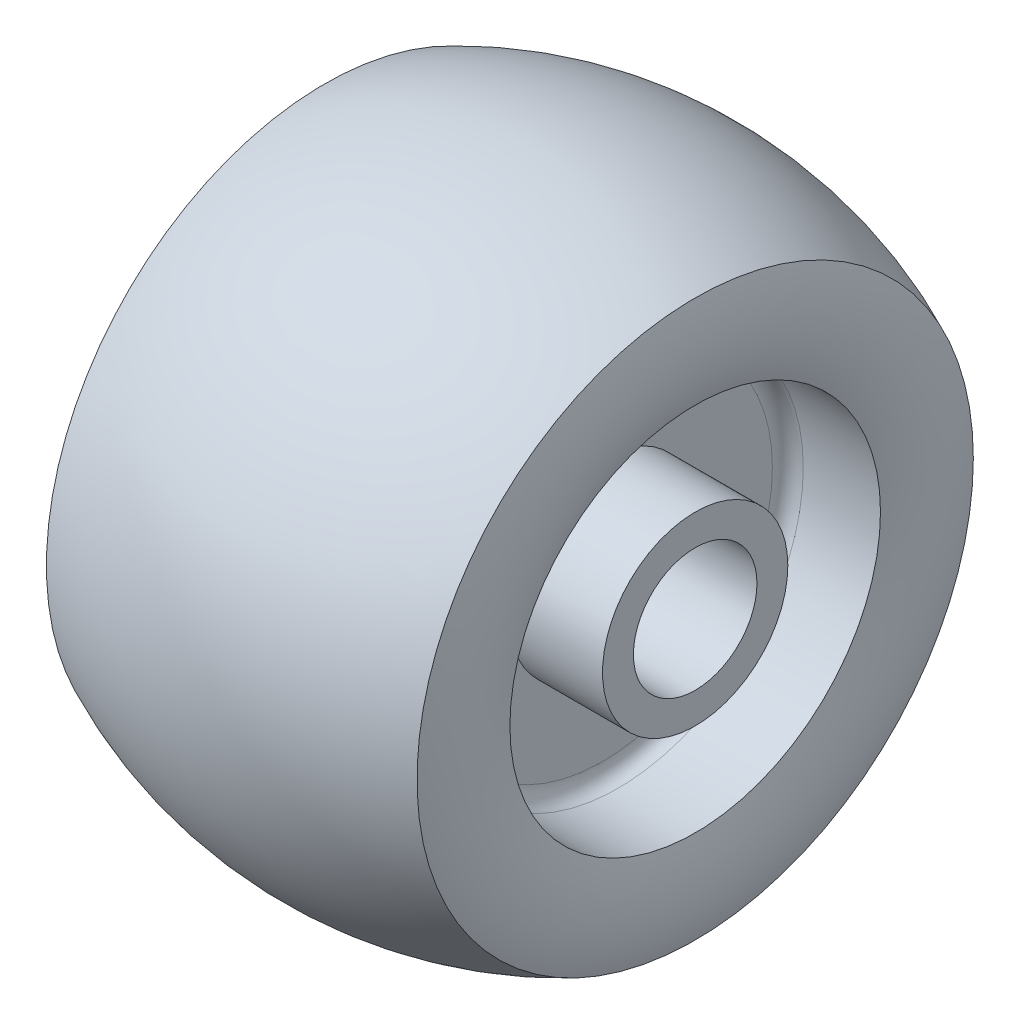
ISO-10303-21;
HEADER;
FILE_DESCRIPTION(('STEP AP214'),'2;1');
FILE_NAME('part.step','',(''),(''),'','','');
FILE_SCHEMA(('AUTOMOTIVE_DESIGN { 1 0 10303 214 1 1 1 1 }'));
ENDSEC;
DATA;
#1=APPLICATION_CONTEXT('core data for automotive mechanical design processes');
#2=APPLICATION_PROTOCOL_DEFINITION('international standard','automotive_design',2000,#1);
#3=PRODUCT_CONTEXT('',#1,'mechanical');
#4=PRODUCT('Part','Part','',(#3));
#5=PRODUCT_RELATED_PRODUCT_CATEGORY('part','',(#4));
#6=PRODUCT_DEFINITION_FORMATION('','',#4);
#7=PRODUCT_DEFINITION_CONTEXT('part definition',#1,'design');
#8=PRODUCT_DEFINITION('design','',#6,#7);
#9=PRODUCT_DEFINITION_SHAPE('','',#8);
#10=(LENGTH_UNIT() NAMED_UNIT(*) SI_UNIT(.MILLI.,.METRE.));
#11=(NAMED_UNIT(*) PLANE_ANGLE_UNIT() SI_UNIT($,.RADIAN.));
#12=(NAMED_UNIT(*) SI_UNIT($,.STERADIAN.) SOLID_ANGLE_UNIT());
#13=UNCERTAINTY_MEASURE_WITH_UNIT(LENGTH_MEASURE(1.E-05),#10,'distance_accuracy_value','');
#14=(GEOMETRIC_REPRESENTATION_CONTEXT(3) GLOBAL_UNCERTAINTY_ASSIGNED_CONTEXT((#13)) GLOBAL_UNIT_ASSIGNED_CONTEXT((#10,
#11,#12)) REPRESENTATION_CONTEXT('',''));
#15=CARTESIAN_POINT('',(0.,0.,0.));
#16=DIRECTION('',(0.,0.,1.));
#17=DIRECTION('',(1.,0.,0.));
#18=AXIS2_PLACEMENT_3D('',#15,#16,#17);
#19=CARTESIAN_POINT('',(-30.,9.99999999999999,0.));
#20=DIRECTION('',(-1.,0.,0.));
#21=DIRECTION('',(0.,0.,1.));
#22=AXIS2_PLACEMENT_3D('',#19,#20,#21);
#23=PLANE('',#22);
#24=CARTESIAN_POINT('',(-30.,0.,0.));
#25=DIRECTION('',(-1.,0.,0.));
#26=DIRECTION('',(0.,0.,1.));
#27=AXIS2_PLACEMENT_3D('',#24,#25,#26);
#28=CIRCLE('',#27,30.);
#29=CARTESIAN_POINT('',(-30.,0.,30.));
#30=VERTEX_POINT('',#29);
#31=EDGE_CURVE('E10',#30,#30,#28,.T.);
#32=ORIENTED_EDGE('',*,*,#31,.F.);
#33=EDGE_LOOP('',(#32));
#34=FACE_BOUND('',#33,.T.);
#35=CARTESIAN_POINT('',(-30.,0.,0.));
#36=DIRECTION('',(1.,0.,0.));
#37=DIRECTION('',(0.,0.,-1.));
#38=AXIS2_PLACEMENT_3D('',#35,#36,#37);
#39=CIRCLE('',#38,55.);
#40=CARTESIAN_POINT('',(-30.,0.,-55.));
#41=VERTEX_POINT('',#40);
#42=EDGE_CURVE('E45',#41,#41,#39,.T.);
#43=ORIENTED_EDGE('',*,*,#42,.F.);
#44=EDGE_LOOP('',(#43));
#45=FACE_BOUND('',#44,.T.);
#46=ADVANCED_FACE('F33',(#34,#45),#23,.T.);
#47=CARTESIAN_POINT('',(-35.,0.,0.));
#48=DIRECTION('',(1.,0.,0.));
#49=DIRECTION('',(0.,0.,-1.));
#50=AXIS2_PLACEMENT_3D('',#47,#48,#49);
#51=TOROIDAL_SURFACE('',#50,55.,5.);
#52=ORIENTED_EDGE('',*,*,#42,.T.);
#53=EDGE_LOOP('',(#52));
#54=FACE_BOUND('',#53,.T.);
#55=CARTESIAN_POINT('',(-35.,0.,0.));
#56=DIRECTION('',(1.,0.,0.));
#57=DIRECTION('',(0.,0.,-1.));
#58=AXIS2_PLACEMENT_3D('',#55,#56,#57);
#59=CIRCLE('',#58,60.);
#60=CARTESIAN_POINT('',(-35.,0.,-60.));
#61=VERTEX_POINT('',#60);
#62=EDGE_CURVE('E68',#61,#61,#59,.T.);
#63=ORIENTED_EDGE('',*,*,#62,.F.);
#64=EDGE_LOOP('',(#63));
#65=FACE_BOUND('',#64,.T.);
#66=ADVANCED_FACE('F74',(#54,#65),#51,.F.);
#67=CARTESIAN_POINT('',(0.,0.,0.));
#68=DIRECTION('',(1.,0.,0.));
#69=DIRECTION('',(0.,0.,-1.));
#70=AXIS2_PLACEMENT_3D('',#67,#68,#69);
#71=CYLINDRICAL_SURFACE('',#70,60.);
#72=ORIENTED_EDGE('',*,*,#62,.T.);
#73=EDGE_LOOP('',(#72));
#74=FACE_BOUND('',#73,.T.);
#75=CARTESIAN_POINT('',(-60.,0.,0.));
#76=DIRECTION('',(1.,0.,0.));
#77=DIRECTION('',(0.,0.,-1.));
#78=AXIS2_PLACEMENT_3D('',#75,#76,#77);
#79=CIRCLE('',#78,60.);
#80=CARTESIAN_POINT('',(-60.,0.,-60.));
#81=VERTEX_POINT('',#80);
#82=EDGE_CURVE('E65',#81,#81,#79,.T.);
#83=ORIENTED_EDGE('',*,*,#82,.F.);
#84=EDGE_LOOP('',(#83));
#85=FACE_BOUND('',#84,.T.);
#86=ADVANCED_FACE('F82',(#74,#85),#71,.F.);
#87=CARTESIAN_POINT('',(-14.8546672905141,0.,0.));
#88=DIRECTION('',(1.,0.,0.));
#89=DIRECTION('',(0.,0.,-1.));
#90=AXIS2_PLACEMENT_3D('',#87,#88,#89);
#91=TOROIDAL_SURFACE('',#90,75.0315455878153,47.582017908121);
#92=ORIENTED_EDGE('',*,*,#82,.T.);
#93=EDGE_LOOP('',(#92));
#94=FACE_BOUND('',#93,.T.);
#95=CARTESIAN_POINT('',(-60.,0.,0.));
#96=DIRECTION('',(1.,0.,0.));
#97=DIRECTION('',(0.,0.,-1.));
#98=AXIS2_PLACEMENT_3D('',#95,#96,#97);
#99=CIRCLE('',#98,90.0630911756305);
#100=CARTESIAN_POINT('',(-60.,0.,-90.0630911756305));
#101=VERTEX_POINT('',#100);
#102=EDGE_CURVE('E62',#101,#101,#99,.T.);
#103=ORIENTED_EDGE('',*,*,#102,.F.);
#104=EDGE_LOOP('',(#103));
#105=FACE_BOUND('',#104,.T.);
#106=ADVANCED_FACE('F86',(#94,#105),#91,.T.);
#107=CARTESIAN_POINT('',(0.,0.,0.));
#108=DIRECTION('',(1.,0.,0.));
#109=DIRECTION('',(0.,0.,-1.));
#110=AXIS2_PLACEMENT_3D('',#107,#108,#109);
#111=DEGENERATE_TOROIDAL_SURFACE('',#110,38.6410002529433,142.002616702844,.F.);
#112=ORIENTED_EDGE('',*,*,#102,.T.);
#113=EDGE_LOOP('',(#112));
#114=FACE_BOUND('',#113,.T.);
#115=CARTESIAN_POINT('',(60.,0.,0.));
#116=DIRECTION('',(1.,0.,0.));
#117=DIRECTION('',(0.,0.,-1.));
#118=AXIS2_PLACEMENT_3D('',#115,#116,#117);
#119=CIRCLE('',#118,90.0630911756305);
#120=CARTESIAN_POINT('',(60.,0.,-90.0630911756305));
#121=VERTEX_POINT('',#120);
#122=EDGE_CURVE('E59',#121,#121,#119,.T.);
#123=ORIENTED_EDGE('',*,*,#122,.F.);
#124=EDGE_LOOP('',(#123));
#125=FACE_BOUND('',#124,.T.);
#126=ADVANCED_FACE('F92',(#114,#125),#111,.F.);
#127=CARTESIAN_POINT('',(14.8546672905141,0.,0.));
#128=DIRECTION('',(1.,0.,0.));
#129=DIRECTION('',(0.,0.,-1.));
#130=AXIS2_PLACEMENT_3D('',#127,#128,#129);
#131=TOROIDAL_SURFACE('',#130,75.0315455878153,47.582017908121);
#132=ORIENTED_EDGE('',*,*,#122,.T.);
#133=EDGE_LOOP('',(#132));
#134=FACE_BOUND('',#133,.T.);
#135=CARTESIAN_POINT('',(60.,0.,0.));
#136=DIRECTION('',(1.,0.,0.));
#137=DIRECTION('',(0.,0.,-1.));
#138=AXIS2_PLACEMENT_3D('',#135,#136,#137);
#139=CIRCLE('',#138,60.);
#140=CARTESIAN_POINT('',(60.,0.,-60.));
#141=VERTEX_POINT('',#140);
#142=EDGE_CURVE('E56',#141,#141,#139,.T.);
#143=ORIENTED_EDGE('',*,*,#142,.F.);
#144=EDGE_LOOP('',(#143));
#145=FACE_BOUND('',#144,.T.);
#146=ADVANCED_FACE('F96',(#134,#145),#131,.T.);
#147=CARTESIAN_POINT('',(0.,0.,0.));
#148=DIRECTION('',(1.,0.,0.));
#149=DIRECTION('',(0.,0.,-1.));
#150=AXIS2_PLACEMENT_3D('',#147,#148,#149);
#151=CYLINDRICAL_SURFACE('',#150,60.);
#152=ORIENTED_EDGE('',*,*,#142,.T.);
#153=EDGE_LOOP('',(#152));
#154=FACE_BOUND('',#153,.T.);
#155=CARTESIAN_POINT('',(35.,0.,0.));
#156=DIRECTION('',(1.,0.,0.));
#157=DIRECTION('',(0.,0.,-1.));
#158=AXIS2_PLACEMENT_3D('',#155,#156,#157);
#159=CIRCLE('',#158,60.);
#160=CARTESIAN_POINT('',(35.,0.,-60.));
#161=VERTEX_POINT('',#160);
#162=EDGE_CURVE('E53',#161,#161,#159,.T.);
#163=ORIENTED_EDGE('',*,*,#162,.F.);
#164=EDGE_LOOP('',(#163));
#165=FACE_BOUND('',#164,.T.);
#166=ADVANCED_FACE('F100',(#154,#165),#151,.F.);
#167=CARTESIAN_POINT('',(35.,0.,0.));
#168=DIRECTION('',(1.,0.,0.));
#169=DIRECTION('',(0.,0.,-1.));
#170=AXIS2_PLACEMENT_3D('',#167,#168,#169);
#171=TOROIDAL_SURFACE('',#170,55.,5.);
#172=ORIENTED_EDGE('',*,*,#162,.T.);
#173=EDGE_LOOP('',(#172));
#174=FACE_BOUND('',#173,.T.);
#175=CARTESIAN_POINT('',(30.,0.,0.));
#176=DIRECTION('',(1.,0.,0.));
#177=DIRECTION('',(0.,0.,-1.));
#178=AXIS2_PLACEMENT_3D('',#175,#176,#177);
#179=CIRCLE('',#178,55.);
#180=CARTESIAN_POINT('',(30.,0.,-55.));
#181=VERTEX_POINT('',#180);
#182=EDGE_CURVE('E50',#181,#181,#179,.T.);
#183=ORIENTED_EDGE('',*,*,#182,.F.);
#184=EDGE_LOOP('',(#183));
#185=FACE_BOUND('',#184,.T.);
#186=ADVANCED_FACE('F104',(#174,#185),#171,.F.);
#187=CARTESIAN_POINT('',(30.,9.99999999999999,0.));
#188=DIRECTION('',(1.,0.,0.));
#189=DIRECTION('',(0.,0.,-1.));
#190=AXIS2_PLACEMENT_3D('',#187,#188,#189);
#191=PLANE('',#190);
#192=CARTESIAN_POINT('',(30.,0.,0.));
#193=DIRECTION('',(1.,0.,0.));
#194=DIRECTION('',(0.,0.,-1.));
#195=AXIS2_PLACEMENT_3D('',#192,#193,#194);
#196=CIRCLE('',#195,30.);
#197=CARTESIAN_POINT('',(30.,0.,-30.));
#198=VERTEX_POINT('',#197);
#199=EDGE_CURVE('E40',#198,#198,#196,.T.);
#200=ORIENTED_EDGE('',*,*,#199,.F.);
#201=EDGE_LOOP('',(#200));
#202=FACE_BOUND('',#201,.T.);
#203=ORIENTED_EDGE('',*,*,#182,.T.);
#204=EDGE_LOOP('',(#203));
#205=FACE_BOUND('',#204,.T.);
#206=ADVANCED_FACE('F108',(#202,#205),#191,.T.);
#207=CARTESIAN_POINT('',(-62.4366851986351,0.,0.));
#208=DIRECTION('',(1.,0.,0.));
#209=DIRECTION('',(0.,0.,-1.));
#210=AXIS2_PLACEMENT_3D('',#207,#208,#209);
#211=CYLINDRICAL_SURFACE('',#210,30.);
#212=ORIENTED_EDGE('',*,*,#199,.T.);
#213=EDGE_LOOP('',(#212));
#214=FACE_BOUND('',#213,.T.);
#215=CARTESIAN_POINT('',(60.,0.,0.));
#216=DIRECTION('',(1.,0.,0.));
#217=DIRECTION('',(0.,0.,-1.));
#218=AXIS2_PLACEMENT_3D('',#215,#216,#217);
#219=CIRCLE('',#218,30.);
#220=CARTESIAN_POINT('',(60.,0.,-30.));
#221=VERTEX_POINT('',#220);
#222=EDGE_CURVE('E138',#221,#221,#219,.T.);
#223=ORIENTED_EDGE('',*,*,#222,.F.);
#224=EDGE_LOOP('',(#223));
#225=FACE_BOUND('',#224,.T.);
#226=ADVANCED_FACE('F112',(#214,#225),#211,.T.);
#227=ORIENTED_EDGE('',*,*,#31,.T.);
#228=EDGE_LOOP('',(#227));
#229=FACE_BOUND('',#228,.T.);
#230=CARTESIAN_POINT('',(-62.4366851986351,0.,0.));
#231=DIRECTION('',(1.,0.,0.));
#232=DIRECTION('',(0.,0.,-1.));
#233=AXIS2_PLACEMENT_3D('',#230,#231,#232);
#234=CIRCLE('',#233,30.);
#235=CARTESIAN_POINT('',(-62.4366851986351,0.,-30.));
#236=VERTEX_POINT('',#235);
#237=EDGE_CURVE('E48',#236,#236,#234,.T.);
#238=ORIENTED_EDGE('',*,*,#237,.T.);
#239=EDGE_LOOP('',(#238));
#240=FACE_BOUND('',#239,.T.);
#241=ADVANCED_FACE('F116',(#229,#240),#211,.T.);
#242=CARTESIAN_POINT('',(-62.4366851986351,0.,0.));
#243=DIRECTION('',(1.,0.,0.));
#244=DIRECTION('',(0.,0.,-1.));
#245=AXIS2_PLACEMENT_3D('',#242,#243,#244);
#246=PLANE('',#245);
#247=CARTESIAN_POINT('',(-62.4366851986351,0.,0.));
#248=DIRECTION('',(-1.,0.,0.));
#249=DIRECTION('',(0.,0.,1.));
#250=AXIS2_PLACEMENT_3D('',#247,#248,#249);
#251=CIRCLE('',#250,20.);
#252=CARTESIAN_POINT('',(-62.4366851986351,0.,20.));
#253=VERTEX_POINT('',#252);
#254=EDGE_CURVE('E136',#253,#253,#251,.T.);
#255=ORIENTED_EDGE('',*,*,#254,.F.);
#256=EDGE_LOOP('',(#255));
#257=FACE_BOUND('',#256,.T.);
#258=ORIENTED_EDGE('',*,*,#237,.F.);
#259=EDGE_LOOP('',(#258));
#260=FACE_BOUND('',#259,.T.);
#261=ADVANCED_FACE('F118',(#257,#260),#246,.F.);
#262=CARTESIAN_POINT('',(60.,0.,0.));
#263=DIRECTION('',(1.,0.,0.));
#264=DIRECTION('',(0.,0.,-1.));
#265=AXIS2_PLACEMENT_3D('',#262,#263,#264);
#266=PLANE('',#265);
#267=CARTESIAN_POINT('',(60.,0.,0.));
#268=DIRECTION('',(1.,0.,0.));
#269=DIRECTION('',(0.,0.,-1.));
#270=AXIS2_PLACEMENT_3D('',#267,#268,#269);
#271=CIRCLE('',#270,20.);
#272=CARTESIAN_POINT('',(60.,0.,-20.));
#273=VERTEX_POINT('',#272);
#274=EDGE_CURVE('E36',#273,#273,#271,.T.);
#275=ORIENTED_EDGE('',*,*,#274,.F.);
#276=EDGE_LOOP('',(#275));
#277=FACE_BOUND('',#276,.T.);
#278=ORIENTED_EDGE('',*,*,#222,.T.);
#279=EDGE_LOOP('',(#278));
#280=FACE_BOUND('',#279,.T.);
#281=ADVANCED_FACE('F121',(#277,#280),#266,.T.);
#282=CARTESIAN_POINT('',(62.4366851986351,0.,0.));
#283=DIRECTION('',(-1.,0.,0.));
#284=DIRECTION('',(0.,0.,1.));
#285=AXIS2_PLACEMENT_3D('',#282,#283,#284);
#286=CYLINDRICAL_SURFACE('',#285,20.);
#287=ORIENTED_EDGE('',*,*,#274,.T.);
#288=EDGE_LOOP('',(#287));
#289=FACE_BOUND('',#288,.T.);
#290=ORIENTED_EDGE('',*,*,#254,.T.);
#291=EDGE_LOOP('',(#290));
#292=FACE_BOUND('',#291,.T.);
#293=ADVANCED_FACE('F125',(#289,#292),#286,.F.);
#294=CLOSED_SHELL('',(#46,#66,#86,#106,#126,#146,#166,#186,#206,#226,#241,#261,#281,#293));
#295=MANIFOLD_SOLID_BREP('B2',#294);
#296=ADVANCED_BREP_SHAPE_REPRESENTATION('',(#18,#295),#14);
#297=SHAPE_DEFINITION_REPRESENTATION(#9,#296);
ENDSEC;
END-ISO-10303-21;
